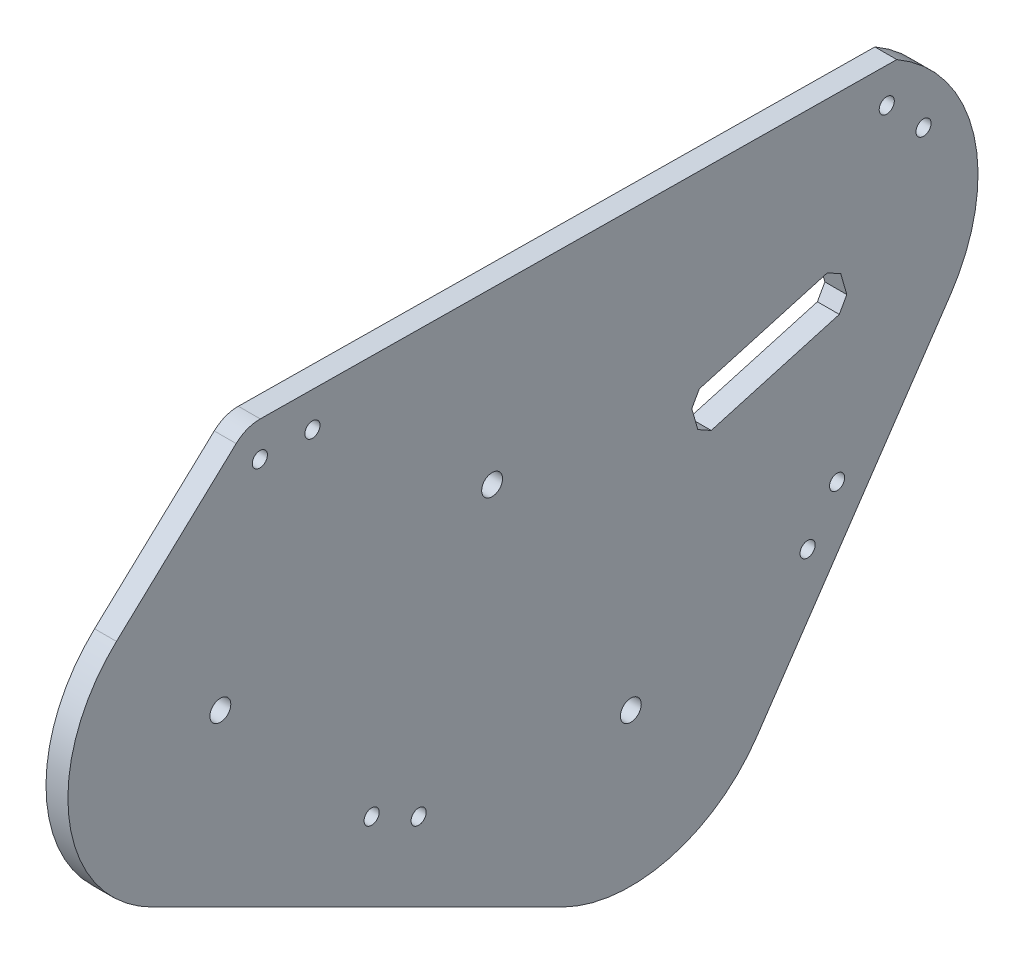
ISO-10303-21;
HEADER;
FILE_DESCRIPTION(('STEP AP214'),'2;1');
FILE_NAME('part.step','',(''),(''),'','','');
FILE_SCHEMA(('AUTOMOTIVE_DESIGN { 1 0 10303 214 1 1 1 1 }'));
ENDSEC;
DATA;
#1=APPLICATION_CONTEXT('core data for automotive mechanical design processes');
#2=APPLICATION_PROTOCOL_DEFINITION('international standard','automotive_design',2000,#1);
#3=PRODUCT_CONTEXT('',#1,'mechanical');
#4=PRODUCT('Part','Part','',(#3));
#5=PRODUCT_RELATED_PRODUCT_CATEGORY('part','',(#4));
#6=PRODUCT_DEFINITION_FORMATION('','',#4);
#7=PRODUCT_DEFINITION_CONTEXT('part definition',#1,'design');
#8=PRODUCT_DEFINITION('design','',#6,#7);
#9=PRODUCT_DEFINITION_SHAPE('','',#8);
#10=(LENGTH_UNIT() NAMED_UNIT(*) SI_UNIT(.MILLI.,.METRE.));
#11=(NAMED_UNIT(*) PLANE_ANGLE_UNIT() SI_UNIT($,.RADIAN.));
#12=(NAMED_UNIT(*) SI_UNIT($,.STERADIAN.) SOLID_ANGLE_UNIT());
#13=UNCERTAINTY_MEASURE_WITH_UNIT(LENGTH_MEASURE(1.E-05),#10,'distance_accuracy_value','');
#14=(GEOMETRIC_REPRESENTATION_CONTEXT(3) GLOBAL_UNCERTAINTY_ASSIGNED_CONTEXT((#13)) GLOBAL_UNIT_ASSIGNED_CONTEXT((#10,
#11,#12)) REPRESENTATION_CONTEXT('',''));
#15=CARTESIAN_POINT('',(0.,0.,0.));
#16=DIRECTION('',(0.,0.,1.));
#17=DIRECTION('',(1.,0.,0.));
#18=AXIS2_PLACEMENT_3D('',#15,#16,#17);
#19=CARTESIAN_POINT('',(-5.,-15.0065003575197,519.783421192923));
#20=DIRECTION('',(1.,0.,0.));
#21=DIRECTION('',(0.,0.,-1.));
#22=AXIS2_PLACEMENT_3D('',#19,#20,#21);
#23=CYLINDRICAL_SURFACE('',#22,34.8040999999985);
#24=CARTESIAN_POINT('',(0.,-15.0065003575197,519.783421192923));
#25=DIRECTION('',(1.,0.,0.));
#26=DIRECTION('',(0.,0.,-1.));
#27=AXIS2_PLACEMENT_3D('',#24,#25,#26);
#28=CIRCLE('',#27,34.8040999999985);
#29=CARTESIAN_POINT('',(0.,10.4622867101921,543.504008498244));
#30=VERTEX_POINT('',#29);
#31=CARTESIAN_POINT('',(0.,-46.1378840028759,535.344986960405));
#32=VERTEX_POINT('',#31);
#33=EDGE_CURVE('E325',#30,#32,#28,.T.);
#34=ORIENTED_EDGE('',*,*,#33,.F.);
#35=DIRECTION('',(1.,0.,0.));
#36=VECTOR('',#35,1.);
#37=CARTESIAN_POINT('',(-5.,10.4622867101921,543.504008498244));
#38=LINE('',#37,#36);
#39=CARTESIAN_POINT('',(-5.,10.4622867101921,543.504008498244));
#40=VERTEX_POINT('',#39);
#41=EDGE_CURVE('E12',#40,#30,#38,.T.);
#42=ORIENTED_EDGE('',*,*,#41,.F.);
#43=CARTESIAN_POINT('',(-5.,-15.0065003575197,519.783421192923));
#44=DIRECTION('',(1.,0.,0.));
#45=DIRECTION('',(0.,0.,-1.));
#46=AXIS2_PLACEMENT_3D('',#43,#44,#45);
#47=CIRCLE('',#46,34.8040999999985);
#48=CARTESIAN_POINT('',(-5.,-46.1378840028759,535.344986960405));
#49=VERTEX_POINT('',#48);
#50=EDGE_CURVE('E301',#40,#49,#47,.T.);
#51=ORIENTED_EDGE('',*,*,#50,.T.);
#52=DIRECTION('',(1.,0.,0.));
#53=VECTOR('',#52,1.);
#54=CARTESIAN_POINT('',(-5.,-46.1378840028759,535.344986960405));
#55=LINE('',#54,#53);
#56=EDGE_CURVE('E43',#49,#32,#55,.T.);
#57=ORIENTED_EDGE('',*,*,#56,.T.);
#58=EDGE_LOOP('',(#34,#42,#51,#57));
#59=FACE_BOUND('',#58,.T.);
#60=ADVANCED_FACE('F40',(#59),#23,.T.);
#61=CARTESIAN_POINT('',(-5.,10.4622867101921,543.504008498244));
#62=DIRECTION('',(0.,0.73177548242058,0.681545774932343));
#63=DIRECTION('',(0.,-0.681545774932343,0.73177548242058));
#64=AXIS2_PLACEMENT_3D('',#61,#62,#63);
#65=PLANE('',#64);
#66=DIRECTION('',(0.,-0.681545774932343,0.73177548242058));
#67=VECTOR('',#66,1.);
#68=CARTESIAN_POINT('',(0.,10.4622867101921,543.504008498244));
#69=LINE('',#68,#67);
#70=CARTESIAN_POINT('',(0.,35.9103864393393,516.180391888879));
#71=VERTEX_POINT('',#70);
#72=EDGE_CURVE('E305',#71,#30,#69,.T.);
#73=ORIENTED_EDGE('',*,*,#72,.F.);
#74=DIRECTION('',(1.,0.,0.));
#75=VECTOR('',#74,1.);
#76=CARTESIAN_POINT('',(-5.,35.9103864393393,516.180391888879));
#77=LINE('',#76,#75);
#78=CARTESIAN_POINT('',(-5.,35.9103864393393,516.180391888879));
#79=VERTEX_POINT('',#78);
#80=EDGE_CURVE('E48',#79,#71,#77,.T.);
#81=ORIENTED_EDGE('',*,*,#80,.F.);
#82=DIRECTION('',(0.,-0.681545774932343,0.73177548242058));
#83=VECTOR('',#82,1.);
#84=CARTESIAN_POINT('',(-5.,10.4622867101921,543.504008498244));
#85=LINE('',#84,#83);
#86=EDGE_CURVE('E323',#79,#40,#85,.T.);
#87=ORIENTED_EDGE('',*,*,#86,.T.);
#88=ORIENTED_EDGE('',*,*,#41,.T.);
#89=EDGE_LOOP('',(#73,#81,#87,#88));
#90=FACE_BOUND('',#89,.T.);
#91=ADVANCED_FACE('F388',(#90),#65,.T.);
#92=CARTESIAN_POINT('',(-5.,30.101918547626,510.770622300354));
#93=DIRECTION('',(1.,0.,0.));
#94=DIRECTION('',(0.,0.,-1.));
#95=AXIS2_PLACEMENT_3D('',#92,#93,#94);
#96=CYLINDRICAL_SURFACE('',#95,7.93749999999995);
#97=CARTESIAN_POINT('',(0.,30.101918547626,510.770622300354));
#98=DIRECTION('',(1.,0.,0.));
#99=DIRECTION('',(0.,0.,-1.));
#100=AXIS2_PLACEMENT_3D('',#97,#98,#99);
#101=CIRCLE('',#100,7.93749999999995);
#102=CARTESIAN_POINT('',(0.,38.0389259271975,510.682190933596));
#103=VERTEX_POINT('',#102);
#104=EDGE_CURVE('E357',#103,#71,#101,.T.);
#105=ORIENTED_EDGE('',*,*,#104,.F.);
#106=DIRECTION('',(1.,0.,0.));
#107=VECTOR('',#106,1.);
#108=CARTESIAN_POINT('',(-5.,38.0389259271975,510.682190933596));
#109=LINE('',#108,#107);
#110=CARTESIAN_POINT('',(-5.,38.0389259271975,510.682190933596));
#111=VERTEX_POINT('',#110);
#112=EDGE_CURVE('E366',#111,#103,#109,.T.);
#113=ORIENTED_EDGE('',*,*,#112,.F.);
#114=CARTESIAN_POINT('',(-5.,30.101918547626,510.770622300354));
#115=DIRECTION('',(1.,0.,0.));
#116=DIRECTION('',(0.,0.,-1.));
#117=AXIS2_PLACEMENT_3D('',#114,#115,#116);
#118=CIRCLE('',#117,7.93749999999995);
#119=EDGE_CURVE('E320',#111,#79,#118,.T.);
#120=ORIENTED_EDGE('',*,*,#119,.T.);
#121=ORIENTED_EDGE('',*,*,#80,.T.);
#122=EDGE_LOOP('',(#105,#113,#120,#121));
#123=FACE_BOUND('',#122,.T.);
#124=ADVANCED_FACE('F487',(#123),#96,.T.);
#125=CARTESIAN_POINT('',(-5.,38.0389259271975,510.682190933596));
#126=DIRECTION('',(0.,0.999937937583819,-0.0111409595914756));
#127=DIRECTION('',(0.,0.0111409595914756,0.999937937583819));
#128=AXIS2_PLACEMENT_3D('',#125,#126,#127);
#129=PLANE('',#128);
#130=DIRECTION('',(0.,0.0111409595914756,0.999937937583819));
#131=VECTOR('',#130,1.);
#132=CARTESIAN_POINT('',(0.,38.0389259271975,510.682190933596));
#133=LINE('',#132,#131);
#134=CARTESIAN_POINT('',(0.,36.4199920525121,365.377526066479));
#135=VERTEX_POINT('',#134);
#136=EDGE_CURVE('E352',#135,#103,#133,.T.);
#137=ORIENTED_EDGE('',*,*,#136,.F.);
#138=DIRECTION('',(1.,0.,0.));
#139=VECTOR('',#138,1.);
#140=CARTESIAN_POINT('',(-5.,36.4199920525121,365.377526066479));
#141=LINE('',#140,#139);
#142=CARTESIAN_POINT('',(-5.,36.4199920525121,365.377526066479));
#143=VERTEX_POINT('',#142);
#144=EDGE_CURVE('E368',#143,#135,#141,.T.);
#145=ORIENTED_EDGE('',*,*,#144,.F.);
#146=DIRECTION('',(0.,0.0111409595914756,0.999937937583819));
#147=VECTOR('',#146,1.);
#148=CARTESIAN_POINT('',(-5.,38.0389259271975,510.682190933596));
#149=LINE('',#148,#147);
#150=EDGE_CURVE('E317',#143,#111,#149,.T.);
#151=ORIENTED_EDGE('',*,*,#150,.T.);
#152=ORIENTED_EDGE('',*,*,#112,.T.);
#153=EDGE_LOOP('',(#137,#145,#151,#152));
#154=FACE_BOUND('',#153,.T.);
#155=ADVANCED_FACE('F492',(#154),#129,.T.);
#156=CARTESIAN_POINT('',(-5.,4.41016788389024,383.725711423616));
#157=DIRECTION('',(1.,0.,0.));
#158=DIRECTION('',(0.,0.,-1.));
#159=AXIS2_PLACEMENT_3D('',#156,#157,#158);
#160=CYLINDRICAL_SURFACE('',#159,36.8955925444483);
#161=CARTESIAN_POINT('',(0.,4.41016788389024,383.725711423616));
#162=DIRECTION('',(1.,0.,0.));
#163=DIRECTION('',(0.,0.,-1.));
#164=AXIS2_PLACEMENT_3D('',#161,#162,#163);
#165=CIRCLE('',#164,36.8955925444483);
#166=CARTESIAN_POINT('',(0.,-16.2849314624056,353.180701810704));
#167=VERTEX_POINT('',#166);
#168=EDGE_CURVE('E347',#167,#135,#165,.T.);
#169=ORIENTED_EDGE('',*,*,#168,.F.);
#170=DIRECTION('',(1.,0.,0.));
#171=VECTOR('',#170,1.);
#172=CARTESIAN_POINT('',(-5.,-16.2849314624056,353.180701810704));
#173=LINE('',#172,#171);
#174=CARTESIAN_POINT('',(-5.,-16.2849314624056,353.180701810704));
#175=VERTEX_POINT('',#174);
#176=EDGE_CURVE('E370',#175,#167,#173,.T.);
#177=ORIENTED_EDGE('',*,*,#176,.F.);
#178=CARTESIAN_POINT('',(-5.,4.41016788389024,383.725711423616));
#179=DIRECTION('',(1.,0.,0.));
#180=DIRECTION('',(0.,0.,-1.));
#181=AXIS2_PLACEMENT_3D('',#178,#179,#180);
#182=CIRCLE('',#181,36.8955925444483);
#183=EDGE_CURVE('E314',#175,#143,#182,.T.);
#184=ORIENTED_EDGE('',*,*,#183,.T.);
#185=ORIENTED_EDGE('',*,*,#144,.T.);
#186=EDGE_LOOP('',(#169,#177,#184,#185));
#187=FACE_BOUND('',#186,.T.);
#188=ADVANCED_FACE('F498',(#187),#160,.T.);
#189=CARTESIAN_POINT('',(-5.,-81.3641503491352,397.273694980719));
#190=DIRECTION('',(0.,-0.560909797596132,-0.82787692259216));
#191=DIRECTION('',(0.,0.82787692259216,-0.560909797596132));
#192=AXIS2_PLACEMENT_3D('',#189,#190,#191);
#193=PLANE('',#192);
#194=DIRECTION('',(0.,0.82787692259216,-0.560909797596132));
#195=VECTOR('',#194,1.);
#196=CARTESIAN_POINT('',(0.,-81.3641503491352,397.273694980719));
#197=LINE('',#196,#195);
#198=CARTESIAN_POINT('',(0.,-81.3641503491352,397.273694980719));
#199=VERTEX_POINT('',#198);
#200=EDGE_CURVE('E343',#199,#167,#197,.T.);
#201=ORIENTED_EDGE('',*,*,#200,.F.);
#202=DIRECTION('',(1.,0.,0.));
#203=VECTOR('',#202,1.);
#204=CARTESIAN_POINT('',(-5.,-81.3641503491352,397.273694980719));
#205=LINE('',#204,#203);
#206=CARTESIAN_POINT('',(-5.,-81.3641503491352,397.273694980719));
#207=VERTEX_POINT('',#206);
#208=EDGE_CURVE('E372',#207,#199,#205,.T.);
#209=ORIENTED_EDGE('',*,*,#208,.F.);
#210=DIRECTION('',(0.,0.82787692259216,-0.560909797596132));
#211=VECTOR('',#210,1.);
#212=CARTESIAN_POINT('',(-5.,-81.3641503491352,397.273694980719));
#213=LINE('',#212,#211);
#214=EDGE_CURVE('E311',#207,#175,#213,.T.);
#215=ORIENTED_EDGE('',*,*,#214,.T.);
#216=ORIENTED_EDGE('',*,*,#176,.T.);
#217=EDGE_LOOP('',(#201,#209,#215,#216));
#218=FACE_BOUND('',#217,.T.);
#219=ADVANCED_FACE('F502',(#218),#193,.T.);
#220=CARTESIAN_POINT('',(-5.,-61.8421896626251,426.087206182307));
#221=DIRECTION('',(1.,0.,0.));
#222=DIRECTION('',(0.,0.,-1.));
#223=AXIS2_PLACEMENT_3D('',#220,#221,#222);
#224=CYLINDRICAL_SURFACE('',#223,34.8040999999959);
#225=CARTESIAN_POINT('',(0.,-61.8421896626251,426.087206182307));
#226=DIRECTION('',(1.,0.,0.));
#227=DIRECTION('',(0.,0.,-1.));
#228=AXIS2_PLACEMENT_3D('',#225,#226,#227);
#229=CIRCLE('',#228,34.8040999999959);
#230=CARTESIAN_POINT('',(0.,-92.9735733079768,441.648771949788));
#231=VERTEX_POINT('',#230);
#232=EDGE_CURVE('E335',#231,#199,#229,.T.);
#233=ORIENTED_EDGE('',*,*,#232,.F.);
#234=DIRECTION('',(1.,0.,0.));
#235=VECTOR('',#234,1.);
#236=CARTESIAN_POINT('',(-5.,-92.9735733079768,441.648771949788));
#237=LINE('',#236,#235);
#238=CARTESIAN_POINT('',(-5.,-92.9735733079768,441.648771949788));
#239=VERTEX_POINT('',#238);
#240=EDGE_CURVE('E373',#239,#231,#237,.T.);
#241=ORIENTED_EDGE('',*,*,#240,.F.);
#242=CARTESIAN_POINT('',(-5.,-61.8421896626251,426.087206182307));
#243=DIRECTION('',(1.,0.,0.));
#244=DIRECTION('',(0.,0.,-1.));
#245=AXIS2_PLACEMENT_3D('',#242,#243,#244);
#246=CIRCLE('',#245,34.8040999999959);
#247=EDGE_CURVE('E308',#239,#207,#246,.T.);
#248=ORIENTED_EDGE('',*,*,#247,.T.);
#249=ORIENTED_EDGE('',*,*,#208,.T.);
#250=EDGE_LOOP('',(#233,#241,#248,#249));
#251=FACE_BOUND('',#250,.T.);
#252=ADVANCED_FACE('F396',(#251),#224,.T.);
#253=CARTESIAN_POINT('',(-5.,-92.9735733079777,441.648771949789));
#254=DIRECTION('',(0.,-0.894474606306614,0.447118752316014));
#255=DIRECTION('',(0.,-0.447118752316014,-0.894474606306614));
#256=AXIS2_PLACEMENT_3D('',#253,#254,#255);
#257=PLANE('',#256);
#258=DIRECTION('',(0.,-0.447118752316014,-0.894474606306614));
#259=VECTOR('',#258,1.);
#260=CARTESIAN_POINT('',(0.,-92.9735733079777,441.648771949789));
#261=LINE('',#260,#259);
#262=EDGE_CURVE('E330',#32,#231,#261,.T.);
#263=ORIENTED_EDGE('',*,*,#262,.F.);
#264=ORIENTED_EDGE('',*,*,#56,.F.);
#265=DIRECTION('',(0.,-0.447118752316014,-0.894474606306614));
#266=VECTOR('',#265,1.);
#267=CARTESIAN_POINT('',(-5.,-92.9735733079777,441.648771949789));
#268=LINE('',#267,#266);
#269=EDGE_CURVE('E304',#49,#239,#268,.T.);
#270=ORIENTED_EDGE('',*,*,#269,.T.);
#271=ORIENTED_EDGE('',*,*,#240,.T.);
#272=EDGE_LOOP('',(#263,#264,#270,#271));
#273=FACE_BOUND('',#272,.T.);
#274=ADVANCED_FACE('F381',(#273),#257,.T.);
#275=CARTESIAN_POINT('',(-5.,-15.0065003575197,519.783421192923));
#276=DIRECTION('',(1.,0.,0.));
#277=DIRECTION('',(0.,0.,-1.));
#278=AXIS2_PLACEMENT_3D('',#275,#276,#277);
#279=PLANE('',#278);
#280=CARTESIAN_POINT('',(-5.,-15.0065003575197,519.783421192923));
#281=DIRECTION('',(1.,0.,0.));
#282=DIRECTION('',(0.,0.,-1.));
#283=AXIS2_PLACEMENT_3D('',#280,#281,#282);
#284=CIRCLE('',#283,2.38124999999995);
#285=CARTESIAN_POINT('',(-5.,-15.0065003575197,517.402171192923));
#286=VERTEX_POINT('',#285);
#287=EDGE_CURVE('E235',#286,#286,#284,.T.);
#288=ORIENTED_EDGE('',*,*,#287,.T.);
#289=EDGE_LOOP('',(#288));
#290=FACE_BOUND('',#289,.T.);
#291=CARTESIAN_POINT('',(-5.,-1.41718755012801,457.754552289623));
#292=DIRECTION('',(1.,0.,0.));
#293=DIRECTION('',(0.,0.,-1.));
#294=AXIS2_PLACEMENT_3D('',#291,#292,#293);
#295=CIRCLE('',#294,2.38125000000001);
#296=CARTESIAN_POINT('',(-5.,-1.41718755012801,455.373302289623));
#297=VERTEX_POINT('',#296);
#298=EDGE_CURVE('E423',#297,#297,#295,.T.);
#299=ORIENTED_EDGE('',*,*,#298,.T.);
#300=EDGE_LOOP('',(#299));
#301=FACE_BOUND('',#300,.T.);
#302=CARTESIAN_POINT('',(-5.,-61.8421896626215,426.087206182307));
#303=DIRECTION('',(1.,0.,0.));
#304=DIRECTION('',(0.,0.,-1.));
#305=AXIS2_PLACEMENT_3D('',#302,#303,#304);
#306=CIRCLE('',#305,2.38125);
#307=CARTESIAN_POINT('',(-5.,-61.8421896626215,423.705956182307));
#308=VERTEX_POINT('',#307);
#309=EDGE_CURVE('E419',#308,#308,#306,.T.);
#310=ORIENTED_EDGE('',*,*,#309,.T.);
#311=EDGE_LOOP('',(#310));
#312=FACE_BOUND('',#311,.T.);
#313=DIRECTION('',(0.,-0.873687878871659,0.486486886064508));
#314=VECTOR('',#313,1.);
#315=CARTESIAN_POINT('',(-5.,-6.13916106529002,410.46313141764));
#316=LINE('',#315,#314);
#317=CARTESIAN_POINT('',(-5.,-6.13916106529002,410.46313141764));
#318=VERTEX_POINT('',#317);
#319=CARTESIAN_POINT('',(-5.,-9.20324699305463,412.169275748676));
#320=VERTEX_POINT('',#319);
#321=EDGE_CURVE('E161',#318,#320,#316,.T.);
#322=ORIENTED_EDGE('',*,*,#321,.T.);
#323=DIRECTION('',(0.,-0.961788799884853,-0.273792447697256));
#324=VECTOR('',#323,1.);
#325=CARTESIAN_POINT('',(-5.,-9.20324699305463,412.169275748676));
#326=LINE('',#325,#324);
#327=CARTESIAN_POINT('',(-5.,-14.012433181109,410.800244566345));
#328=VERTEX_POINT('',#327);
#329=EDGE_CURVE('E155',#320,#328,#326,.T.);
#330=ORIENTED_EDGE('',*,*,#329,.T.);
#331=DIRECTION('',(0.,-0.486486886064026,-0.873687878871927));
#332=VECTOR('',#331,1.);
#333=CARTESIAN_POINT('',(-5.,-14.012433181109,410.800244566345));
#334=LINE('',#333,#332);
#335=CARTESIAN_POINT('',(-5.,-15.7185775121433,407.736158638581));
#336=VERTEX_POINT('',#335);
#337=EDGE_CURVE('E164',#328,#336,#334,.T.);
#338=ORIENTED_EDGE('',*,*,#337,.T.);
#339=DIRECTION('',(0.,0.273792447696789,-0.961788799884986));
#340=VECTOR('',#339,1.);
#341=CARTESIAN_POINT('',(-5.,-15.7185775121434,407.736158638581));
#342=LINE('',#341,#340);
#343=CARTESIAN_POINT('',(-5.,-7.39521815831649,378.497536933448));
#344=VERTEX_POINT('',#343);
#345=EDGE_CURVE('E56',#336,#344,#342,.T.);
#346=ORIENTED_EDGE('',*,*,#345,.T.);
#347=DIRECTION('',(0.,0.873687878872062,-0.486486886063784));
#348=VECTOR('',#347,1.);
#349=CARTESIAN_POINT('',(-5.,-7.39521815831649,378.497536933448));
#350=LINE('',#349,#348);
#351=CARTESIAN_POINT('',(-5.,-4.3311322305511,376.791392602415));
#352=VERTEX_POINT('',#351);
#353=EDGE_CURVE('E184',#344,#352,#350,.T.);
#354=ORIENTED_EDGE('',*,*,#353,.T.);
#355=DIRECTION('',(0.,0.961788799884977,0.27379244769682));
#356=VECTOR('',#355,1.);
#357=CARTESIAN_POINT('',(-5.,-4.3311322305511,376.791392602415));
#358=LINE('',#357,#356);
#359=CARTESIAN_POINT('',(-5.,0.478053957504907,378.160423784744));
#360=VERTEX_POINT('',#359);
#361=EDGE_CURVE('E187',#352,#360,#358,.T.);
#362=ORIENTED_EDGE('',*,*,#361,.T.);
#363=DIRECTION('',(0.,0.486486886063821,0.873687878872041));
#364=VECTOR('',#363,1.);
#365=CARTESIAN_POINT('',(-5.,0.478053957504907,378.160423784744));
#366=LINE('',#365,#364);
#367=CARTESIAN_POINT('',(-5.,2.18419828853847,381.224509712509));
#368=VERTEX_POINT('',#367);
#369=EDGE_CURVE('E190',#360,#368,#366,.T.);
#370=ORIENTED_EDGE('',*,*,#369,.T.);
#371=DIRECTION('',(0.,-0.273792447696849,0.961788799884968));
#372=VECTOR('',#371,1.);
#373=CARTESIAN_POINT('',(-5.,2.18419828853847,381.224509712509));
#374=LINE('',#373,#372);
#375=EDGE_CURVE('E193',#368,#318,#374,.T.);
#376=ORIENTED_EDGE('',*,*,#375,.T.);
#377=EDGE_LOOP('',(#322,#330,#338,#346,#354,#362,#370,#376));
#378=FACE_BOUND('',#377,.T.);
#379=CARTESIAN_POINT('',(-5.,-50.185658720557,385.737171654481));
#380=DIRECTION('',(1.,0.,0.));
#381=DIRECTION('',(0.,0.,-1.));
#382=AXIS2_PLACEMENT_3D('',#379,#380,#381);
#383=CIRCLE('',#382,1.72719999999997);
#384=CARTESIAN_POINT('',(-5.,-50.185658720557,384.009971654481));
#385=VERTEX_POINT('',#384);
#386=EDGE_CURVE('E226',#385,#385,#383,.T.);
#387=ORIENTED_EDGE('',*,*,#386,.T.);
#388=EDGE_LOOP('',(#387));
#389=FACE_BOUND('',#388,.T.);
#390=CARTESIAN_POINT('',(-5.,-40.2511356494511,379.006254083328));
#391=DIRECTION('',(1.,0.,0.));
#392=DIRECTION('',(0.,0.,-1.));
#393=AXIS2_PLACEMENT_3D('',#390,#391,#392);
#394=CIRCLE('',#393,1.72720000000003);
#395=CARTESIAN_POINT('',(-5.,-40.2511356494511,377.279054083328));
#396=VERTEX_POINT('',#395);
#397=EDGE_CURVE('E236',#396,#396,#394,.T.);
#398=ORIENTED_EDGE('',*,*,#397,.T.);
#399=EDGE_LOOP('',(#398));
#400=FACE_BOUND('',#399,.T.);
#401=CARTESIAN_POINT('',(-5.,19.9282164771804,359.276554144292));
#402=DIRECTION('',(1.,0.,0.));
#403=DIRECTION('',(0.,0.,-1.));
#404=AXIS2_PLACEMENT_3D('',#401,#402,#403);
#405=CIRCLE('',#404,1.72720000000003);
#406=CARTESIAN_POINT('',(-5.,19.9282164771804,357.549354144292));
#407=VERTEX_POINT('',#406);
#408=EDGE_CURVE('E249',#407,#407,#405,.T.);
#409=ORIENTED_EDGE('',*,*,#408,.T.);
#410=EDGE_LOOP('',(#409));
#411=FACE_BOUND('',#410,.T.);
#412=CARTESIAN_POINT('',(-5.,28.5075054112676,367.666774724554));
#413=DIRECTION('',(1.,0.,0.));
#414=DIRECTION('',(0.,0.,-1.));
#415=AXIS2_PLACEMENT_3D('',#412,#413,#414);
#416=CIRCLE('',#415,1.72719999999997);
#417=CARTESIAN_POINT('',(-5.,28.5075054112676,365.939574724554));
#418=VERTEX_POINT('',#417);
#419=EDGE_CURVE('E257',#418,#418,#416,.T.);
#420=ORIENTED_EDGE('',*,*,#419,.T.);
#421=EDGE_LOOP('',(#420));
#422=FACE_BOUND('',#421,.T.);
#423=CARTESIAN_POINT('',(-5.,29.9682270325283,498.771367049348));
#424=DIRECTION('',(1.,0.,0.));
#425=DIRECTION('',(0.,0.,-1.));
#426=AXIS2_PLACEMENT_3D('',#423,#424,#425);
#427=CIRCLE('',#426,1.72719999999997);
#428=CARTESIAN_POINT('',(-5.,29.9682270325283,497.044167049348));
#429=VERTEX_POINT('',#428);
#430=EDGE_CURVE('E265',#429,#429,#427,.T.);
#431=ORIENTED_EDGE('',*,*,#430,.T.);
#432=EDGE_LOOP('',(#431));
#433=FACE_BOUND('',#432,.T.);
#434=CARTESIAN_POINT('',(-5.,30.101918547626,510.770622300354));
#435=DIRECTION('',(1.,0.,0.));
#436=DIRECTION('',(0.,0.,-1.));
#437=AXIS2_PLACEMENT_3D('',#434,#435,#436);
#438=CIRCLE('',#437,1.72720000000008);
#439=CARTESIAN_POINT('',(-5.,30.101918547626,509.043422300354));
#440=VERTEX_POINT('',#439);
#441=EDGE_CURVE('E275',#440,#440,#438,.T.);
#442=ORIENTED_EDGE('',*,*,#441,.T.);
#443=EDGE_LOOP('',(#442));
#444=FACE_BOUND('',#443,.T.);
#445=CARTESIAN_POINT('',(-5.,-58.65529333969,474.518853751606));
#446=DIRECTION('',(1.,0.,0.));
#447=DIRECTION('',(0.,0.,-1.));
#448=AXIS2_PLACEMENT_3D('',#445,#446,#447);
#449=CIRCLE('',#448,1.72719999999997);
#450=CARTESIAN_POINT('',(-5.,-58.65529333969,472.791653751606));
#451=VERTEX_POINT('',#450);
#452=EDGE_CURVE('E283',#451,#451,#449,.T.);
#453=ORIENTED_EDGE('',*,*,#452,.T.);
#454=EDGE_LOOP('',(#453));
#455=FACE_BOUND('',#454,.T.);
#456=CARTESIAN_POINT('',(-5.,-53.2898683118975,485.252549027286));
#457=DIRECTION('',(1.,0.,0.));
#458=DIRECTION('',(0.,0.,-1.));
#459=AXIS2_PLACEMENT_3D('',#456,#457,#458);
#460=CIRCLE('',#459,1.72719999999997);
#461=CARTESIAN_POINT('',(-5.,-53.2898683118975,483.525349027286));
#462=VERTEX_POINT('',#461);
#463=EDGE_CURVE('E291',#462,#462,#460,.T.);
#464=ORIENTED_EDGE('',*,*,#463,.T.);
#465=EDGE_LOOP('',(#464));
#466=FACE_BOUND('',#465,.T.);
#467=ORIENTED_EDGE('',*,*,#50,.F.);
#468=ORIENTED_EDGE('',*,*,#86,.F.);
#469=ORIENTED_EDGE('',*,*,#119,.F.);
#470=ORIENTED_EDGE('',*,*,#150,.F.);
#471=ORIENTED_EDGE('',*,*,#183,.F.);
#472=ORIENTED_EDGE('',*,*,#214,.F.);
#473=ORIENTED_EDGE('',*,*,#247,.F.);
#474=ORIENTED_EDGE('',*,*,#269,.F.);
#475=EDGE_LOOP('',(#467,#468,#469,#470,#471,#472,#473,#474));
#476=FACE_BOUND('',#475,.T.);
#477=ADVANCED_FACE('F168',(#290,#301,#312,#378,#389,#400,#411,#422,#433,#444,#455,#466,#476),
#279,.F.);
#478=CARTESIAN_POINT('',(0.,-15.0065003575197,519.783421192923));
#479=DIRECTION('',(1.,0.,0.));
#480=DIRECTION('',(0.,0.,-1.));
#481=AXIS2_PLACEMENT_3D('',#478,#479,#480);
#482=PLANE('',#481);
#483=CARTESIAN_POINT('',(0.,-15.0065003575197,519.783421192923));
#484=DIRECTION('',(1.,0.,0.));
#485=DIRECTION('',(0.,0.,-1.));
#486=AXIS2_PLACEMENT_3D('',#483,#484,#485);
#487=CIRCLE('',#486,2.38124999999995);
#488=CARTESIAN_POINT('',(0.,-15.0065003575197,517.402171192923));
#489=VERTEX_POINT('',#488);
#490=EDGE_CURVE('E425',#489,#489,#487,.T.);
#491=ORIENTED_EDGE('',*,*,#490,.F.);
#492=EDGE_LOOP('',(#491));
#493=FACE_BOUND('',#492,.T.);
#494=CARTESIAN_POINT('',(0.,-1.41718755012801,457.754552289623));
#495=DIRECTION('',(1.,0.,0.));
#496=DIRECTION('',(0.,0.,-1.));
#497=AXIS2_PLACEMENT_3D('',#494,#495,#496);
#498=CIRCLE('',#497,2.38125000000001);
#499=CARTESIAN_POINT('',(0.,-1.41718755012801,455.373302289623));
#500=VERTEX_POINT('',#499);
#501=EDGE_CURVE('E420',#500,#500,#498,.T.);
#502=ORIENTED_EDGE('',*,*,#501,.F.);
#503=EDGE_LOOP('',(#502));
#504=FACE_BOUND('',#503,.T.);
#505=CARTESIAN_POINT('',(0.,-61.8421896626215,426.087206182307));
#506=DIRECTION('',(1.,0.,0.));
#507=DIRECTION('',(0.,0.,-1.));
#508=AXIS2_PLACEMENT_3D('',#505,#506,#507);
#509=CIRCLE('',#508,2.38125);
#510=CARTESIAN_POINT('',(0.,-61.8421896626215,423.705956182307));
#511=VERTEX_POINT('',#510);
#512=EDGE_CURVE('E179',#511,#511,#509,.T.);
#513=ORIENTED_EDGE('',*,*,#512,.F.);
#514=EDGE_LOOP('',(#513));
#515=FACE_BOUND('',#514,.T.);
#516=DIRECTION('',(0.,-0.961788799884853,-0.273792447697256));
#517=VECTOR('',#516,1.);
#518=CARTESIAN_POINT('',(0.,-9.20324699305463,412.169275748676));
#519=LINE('',#518,#517);
#520=CARTESIAN_POINT('',(0.,-9.20324699305463,412.169275748676));
#521=VERTEX_POINT('',#520);
#522=CARTESIAN_POINT('',(0.,-14.012433181109,410.800244566345));
#523=VERTEX_POINT('',#522);
#524=EDGE_CURVE('E64',#521,#523,#519,.T.);
#525=ORIENTED_EDGE('',*,*,#524,.F.);
#526=DIRECTION('',(0.,-0.873687878871659,0.486486886064508));
#527=VECTOR('',#526,1.);
#528=CARTESIAN_POINT('',(0.,-6.13916106529002,410.46313141764));
#529=LINE('',#528,#527);
#530=CARTESIAN_POINT('',(0.,-6.13916106529002,410.46313141764));
#531=VERTEX_POINT('',#530);
#532=EDGE_CURVE('E172',#531,#521,#529,.T.);
#533=ORIENTED_EDGE('',*,*,#532,.F.);
#534=DIRECTION('',(0.,-0.273792447696849,0.961788799884968));
#535=VECTOR('',#534,1.);
#536=CARTESIAN_POINT('',(0.,2.18419828853847,381.224509712509));
#537=LINE('',#536,#535);
#538=CARTESIAN_POINT('',(0.,2.18419828853847,381.224509712509));
#539=VERTEX_POINT('',#538);
#540=EDGE_CURVE('E176',#539,#531,#537,.T.);
#541=ORIENTED_EDGE('',*,*,#540,.F.);
#542=DIRECTION('',(0.,0.486486886063821,0.873687878872041));
#543=VECTOR('',#542,1.);
#544=CARTESIAN_POINT('',(0.,0.478053957504907,378.160423784744));
#545=LINE('',#544,#543);
#546=CARTESIAN_POINT('',(0.,0.478053957504907,378.160423784744));
#547=VERTEX_POINT('',#546);
#548=EDGE_CURVE('E411',#547,#539,#545,.T.);
#549=ORIENTED_EDGE('',*,*,#548,.F.);
#550=DIRECTION('',(0.,0.961788799884977,0.27379244769682));
#551=VECTOR('',#550,1.);
#552=CARTESIAN_POINT('',(0.,-4.3311322305511,376.791392602415));
#553=LINE('',#552,#551);
#554=CARTESIAN_POINT('',(0.,-4.3311322305511,376.791392602415));
#555=VERTEX_POINT('',#554);
#556=EDGE_CURVE('E407',#555,#547,#553,.T.);
#557=ORIENTED_EDGE('',*,*,#556,.F.);
#558=DIRECTION('',(0.,0.873687878872062,-0.486486886063784));
#559=VECTOR('',#558,1.);
#560=CARTESIAN_POINT('',(0.,-7.39521815831649,378.497536933448));
#561=LINE('',#560,#559);
#562=CARTESIAN_POINT('',(0.,-7.39521815831649,378.497536933448));
#563=VERTEX_POINT('',#562);
#564=EDGE_CURVE('E404',#563,#555,#561,.T.);
#565=ORIENTED_EDGE('',*,*,#564,.F.);
#566=DIRECTION('',(0.,0.273792447696789,-0.961788799884986));
#567=VECTOR('',#566,1.);
#568=CARTESIAN_POINT('',(0.,-15.7185775121434,407.736158638581));
#569=LINE('',#568,#567);
#570=CARTESIAN_POINT('',(0.,-15.7185775121434,407.736158638581));
#571=VERTEX_POINT('',#570);
#572=EDGE_CURVE('E401',#571,#563,#569,.T.);
#573=ORIENTED_EDGE('',*,*,#572,.F.);
#574=DIRECTION('',(0.,-0.486486886064026,-0.873687878871927));
#575=VECTOR('',#574,1.);
#576=CARTESIAN_POINT('',(0.,-14.012433181109,410.800244566345));
#577=LINE('',#576,#575);
#578=EDGE_CURVE('E199',#523,#571,#577,.T.);
#579=ORIENTED_EDGE('',*,*,#578,.F.);
#580=EDGE_LOOP('',(#525,#533,#541,#549,#557,#565,#573,#579));
#581=FACE_BOUND('',#580,.T.);
#582=CARTESIAN_POINT('',(0.,-50.185658720557,385.737171654481));
#583=DIRECTION('',(1.,0.,0.));
#584=DIRECTION('',(0.,0.,-1.));
#585=AXIS2_PLACEMENT_3D('',#582,#583,#584);
#586=CIRCLE('',#585,1.72719999999997);
#587=CARTESIAN_POINT('',(0.,-50.185658720557,384.009971654481));
#588=VERTEX_POINT('',#587);
#589=EDGE_CURVE('E230',#588,#588,#586,.T.);
#590=ORIENTED_EDGE('',*,*,#589,.F.);
#591=EDGE_LOOP('',(#590));
#592=FACE_BOUND('',#591,.T.);
#593=CARTESIAN_POINT('',(0.,-40.2511356494511,379.006254083328));
#594=DIRECTION('',(1.,0.,0.));
#595=DIRECTION('',(0.,0.,-1.));
#596=AXIS2_PLACEMENT_3D('',#593,#594,#595);
#597=CIRCLE('',#596,1.72720000000003);
#598=CARTESIAN_POINT('',(0.,-40.2511356494511,377.279054083328));
#599=VERTEX_POINT('',#598);
#600=EDGE_CURVE('E229',#599,#599,#597,.T.);
#601=ORIENTED_EDGE('',*,*,#600,.F.);
#602=EDGE_LOOP('',(#601));
#603=FACE_BOUND('',#602,.T.);
#604=CARTESIAN_POINT('',(0.,19.9282164771804,359.276554144292));
#605=DIRECTION('',(1.,0.,0.));
#606=DIRECTION('',(0.,0.,-1.));
#607=AXIS2_PLACEMENT_3D('',#604,#605,#606);
#608=CIRCLE('',#607,1.72720000000003);
#609=CARTESIAN_POINT('',(0.,19.9282164771804,357.549354144292));
#610=VERTEX_POINT('',#609);
#611=EDGE_CURVE('E252',#610,#610,#608,.T.);
#612=ORIENTED_EDGE('',*,*,#611,.F.);
#613=EDGE_LOOP('',(#612));
#614=FACE_BOUND('',#613,.T.);
#615=CARTESIAN_POINT('',(0.,28.5075054112676,367.666774724554));
#616=DIRECTION('',(1.,0.,0.));
#617=DIRECTION('',(0.,0.,-1.));
#618=AXIS2_PLACEMENT_3D('',#615,#616,#617);
#619=CIRCLE('',#618,1.72719999999997);
#620=CARTESIAN_POINT('',(0.,28.5075054112676,365.939574724554));
#621=VERTEX_POINT('',#620);
#622=EDGE_CURVE('E251',#621,#621,#619,.T.);
#623=ORIENTED_EDGE('',*,*,#622,.F.);
#624=EDGE_LOOP('',(#623));
#625=FACE_BOUND('',#624,.T.);
#626=CARTESIAN_POINT('',(0.,29.9682270325283,498.771367049348));
#627=DIRECTION('',(1.,0.,0.));
#628=DIRECTION('',(0.,0.,-1.));
#629=AXIS2_PLACEMENT_3D('',#626,#627,#628);
#630=CIRCLE('',#629,1.72719999999997);
#631=CARTESIAN_POINT('',(0.,29.9682270325283,497.044167049348));
#632=VERTEX_POINT('',#631);
#633=EDGE_CURVE('E260',#632,#632,#630,.T.);
#634=ORIENTED_EDGE('',*,*,#633,.F.);
#635=EDGE_LOOP('',(#634));
#636=FACE_BOUND('',#635,.T.);
#637=CARTESIAN_POINT('',(0.,30.101918547626,510.770622300354));
#638=DIRECTION('',(1.,0.,0.));
#639=DIRECTION('',(0.,0.,-1.));
#640=AXIS2_PLACEMENT_3D('',#637,#638,#639);
#641=CIRCLE('',#640,1.72720000000008);
#642=CARTESIAN_POINT('',(0.,30.101918547626,509.043422300354));
#643=VERTEX_POINT('',#642);
#644=EDGE_CURVE('E278',#643,#643,#641,.T.);
#645=ORIENTED_EDGE('',*,*,#644,.F.);
#646=EDGE_LOOP('',(#645));
#647=FACE_BOUND('',#646,.T.);
#648=CARTESIAN_POINT('',(0.,-58.65529333969,474.518853751606));
#649=DIRECTION('',(1.,0.,0.));
#650=DIRECTION('',(0.,0.,-1.));
#651=AXIS2_PLACEMENT_3D('',#648,#649,#650);
#652=CIRCLE('',#651,1.72719999999997);
#653=CARTESIAN_POINT('',(0.,-58.65529333969,472.791653751606));
#654=VERTEX_POINT('',#653);
#655=EDGE_CURVE('E277',#654,#654,#652,.T.);
#656=ORIENTED_EDGE('',*,*,#655,.F.);
#657=EDGE_LOOP('',(#656));
#658=FACE_BOUND('',#657,.T.);
#659=CARTESIAN_POINT('',(0.,-53.2898683118975,485.252549027286));
#660=DIRECTION('',(1.,0.,0.));
#661=DIRECTION('',(0.,0.,-1.));
#662=AXIS2_PLACEMENT_3D('',#659,#660,#661);
#663=CIRCLE('',#662,1.72719999999997);
#664=CARTESIAN_POINT('',(0.,-53.2898683118975,483.525349027286));
#665=VERTEX_POINT('',#664);
#666=EDGE_CURVE('E286',#665,#665,#663,.T.);
#667=ORIENTED_EDGE('',*,*,#666,.F.);
#668=EDGE_LOOP('',(#667));
#669=FACE_BOUND('',#668,.T.);
#670=ORIENTED_EDGE('',*,*,#33,.T.);
#671=ORIENTED_EDGE('',*,*,#262,.T.);
#672=ORIENTED_EDGE('',*,*,#232,.T.);
#673=ORIENTED_EDGE('',*,*,#200,.T.);
#674=ORIENTED_EDGE('',*,*,#168,.T.);
#675=ORIENTED_EDGE('',*,*,#136,.T.);
#676=ORIENTED_EDGE('',*,*,#104,.T.);
#677=ORIENTED_EDGE('',*,*,#72,.T.);
#678=EDGE_LOOP('',(#670,#671,#672,#673,#674,#675,#676,#677));
#679=FACE_BOUND('',#678,.T.);
#680=ADVANCED_FACE('F384',(#493,#504,#515,#581,#592,#603,#614,#625,#636,#647,#658,#669,#679),
#482,.T.);
#681=CARTESIAN_POINT('',(-5.,-53.2898683118975,485.252549027286));
#682=DIRECTION('',(1.,0.,0.));
#683=DIRECTION('',(0.,0.,-1.));
#684=AXIS2_PLACEMENT_3D('',#681,#682,#683);
#685=CYLINDRICAL_SURFACE('',#684,1.72719999999997);
#686=ORIENTED_EDGE('',*,*,#463,.F.);
#687=EDGE_LOOP('',(#686));
#688=FACE_BOUND('',#687,.T.);
#689=ORIENTED_EDGE('',*,*,#666,.T.);
#690=EDGE_LOOP('',(#689));
#691=FACE_BOUND('',#690,.T.);
#692=ADVANCED_FACE('F450',(#688,#691),#685,.F.);
#693=CARTESIAN_POINT('',(-5.,-58.65529333969,474.518853751606));
#694=DIRECTION('',(1.,0.,0.));
#695=DIRECTION('',(0.,0.,-1.));
#696=AXIS2_PLACEMENT_3D('',#693,#694,#695);
#697=CYLINDRICAL_SURFACE('',#696,1.72719999999997);
#698=ORIENTED_EDGE('',*,*,#452,.F.);
#699=EDGE_LOOP('',(#698));
#700=FACE_BOUND('',#699,.T.);
#701=ORIENTED_EDGE('',*,*,#655,.T.);
#702=EDGE_LOOP('',(#701));
#703=FACE_BOUND('',#702,.T.);
#704=ADVANCED_FACE('F472',(#700,#703),#697,.F.);
#705=CARTESIAN_POINT('',(-5.,30.101918547626,510.770622300354));
#706=DIRECTION('',(1.,0.,0.));
#707=DIRECTION('',(0.,0.,-1.));
#708=AXIS2_PLACEMENT_3D('',#705,#706,#707);
#709=CYLINDRICAL_SURFACE('',#708,1.72720000000008);
#710=ORIENTED_EDGE('',*,*,#441,.F.);
#711=EDGE_LOOP('',(#710));
#712=FACE_BOUND('',#711,.T.);
#713=ORIENTED_EDGE('',*,*,#644,.T.);
#714=EDGE_LOOP('',(#713));
#715=FACE_BOUND('',#714,.T.);
#716=ADVANCED_FACE('F478',(#712,#715),#709,.F.);
#717=CARTESIAN_POINT('',(-5.,29.9682270325283,498.771367049348));
#718=DIRECTION('',(1.,0.,0.));
#719=DIRECTION('',(0.,0.,-1.));
#720=AXIS2_PLACEMENT_3D('',#717,#718,#719);
#721=CYLINDRICAL_SURFACE('',#720,1.72719999999997);
#722=ORIENTED_EDGE('',*,*,#430,.F.);
#723=EDGE_LOOP('',(#722));
#724=FACE_BOUND('',#723,.T.);
#725=ORIENTED_EDGE('',*,*,#633,.T.);
#726=EDGE_LOOP('',(#725));
#727=FACE_BOUND('',#726,.T.);
#728=ADVANCED_FACE('F573',(#724,#727),#721,.F.);
#729=CARTESIAN_POINT('',(-5.,28.5075054112676,367.666774724554));
#730=DIRECTION('',(1.,0.,0.));
#731=DIRECTION('',(0.,0.,-1.));
#732=AXIS2_PLACEMENT_3D('',#729,#730,#731);
#733=CYLINDRICAL_SURFACE('',#732,1.72719999999997);
#734=ORIENTED_EDGE('',*,*,#419,.F.);
#735=EDGE_LOOP('',(#734));
#736=FACE_BOUND('',#735,.T.);
#737=ORIENTED_EDGE('',*,*,#622,.T.);
#738=EDGE_LOOP('',(#737));
#739=FACE_BOUND('',#738,.T.);
#740=ADVANCED_FACE('F569',(#736,#739),#733,.F.);
#741=CARTESIAN_POINT('',(-5.,19.9282164771804,359.276554144292));
#742=DIRECTION('',(1.,0.,0.));
#743=DIRECTION('',(0.,0.,-1.));
#744=AXIS2_PLACEMENT_3D('',#741,#742,#743);
#745=CYLINDRICAL_SURFACE('',#744,1.72720000000003);
#746=ORIENTED_EDGE('',*,*,#408,.F.);
#747=EDGE_LOOP('',(#746));
#748=FACE_BOUND('',#747,.T.);
#749=ORIENTED_EDGE('',*,*,#611,.T.);
#750=EDGE_LOOP('',(#749));
#751=FACE_BOUND('',#750,.T.);
#752=ADVANCED_FACE('F565',(#748,#751),#745,.F.);
#753=CARTESIAN_POINT('',(-5.,-40.2511356494511,379.006254083328));
#754=DIRECTION('',(1.,0.,0.));
#755=DIRECTION('',(0.,0.,-1.));
#756=AXIS2_PLACEMENT_3D('',#753,#754,#755);
#757=CYLINDRICAL_SURFACE('',#756,1.72720000000003);
#758=ORIENTED_EDGE('',*,*,#397,.F.);
#759=EDGE_LOOP('',(#758));
#760=FACE_BOUND('',#759,.T.);
#761=ORIENTED_EDGE('',*,*,#600,.T.);
#762=EDGE_LOOP('',(#761));
#763=FACE_BOUND('',#762,.T.);
#764=ADVANCED_FACE('F561',(#760,#763),#757,.F.);
#765=CARTESIAN_POINT('',(-5.,-50.185658720557,385.737171654481));
#766=DIRECTION('',(1.,0.,0.));
#767=DIRECTION('',(0.,0.,-1.));
#768=AXIS2_PLACEMENT_3D('',#765,#766,#767);
#769=CYLINDRICAL_SURFACE('',#768,1.72719999999997);
#770=ORIENTED_EDGE('',*,*,#386,.F.);
#771=EDGE_LOOP('',(#770));
#772=FACE_BOUND('',#771,.T.);
#773=ORIENTED_EDGE('',*,*,#589,.T.);
#774=EDGE_LOOP('',(#773));
#775=FACE_BOUND('',#774,.T.);
#776=ADVANCED_FACE('F558',(#772,#775),#769,.F.);
#777=CARTESIAN_POINT('',(-5.,-9.20324699305463,412.169275748676));
#778=DIRECTION('',(0.,-0.273792447697256,0.961788799884853));
#779=DIRECTION('',(0.,-0.961788799884853,-0.273792447697256));
#780=AXIS2_PLACEMENT_3D('',#777,#778,#779);
#781=PLANE('',#780);
#782=ORIENTED_EDGE('',*,*,#524,.T.);
#783=DIRECTION('',(1.,0.,0.));
#784=VECTOR('',#783,1.);
#785=CARTESIAN_POINT('',(-5.,-14.012433181109,410.800244566345));
#786=LINE('',#785,#784);
#787=EDGE_CURVE('E151',#328,#523,#786,.T.);
#788=ORIENTED_EDGE('',*,*,#787,.F.);
#789=ORIENTED_EDGE('',*,*,#329,.F.);
#790=DIRECTION('',(1.,0.,0.));
#791=VECTOR('',#790,1.);
#792=CARTESIAN_POINT('',(-5.,-9.20324699305463,412.169275748676));
#793=LINE('',#792,#791);
#794=EDGE_CURVE('E213',#320,#521,#793,.T.);
#795=ORIENTED_EDGE('',*,*,#794,.T.);
#796=EDGE_LOOP('',(#782,#788,#789,#795));
#797=FACE_BOUND('',#796,.T.);
#798=ADVANCED_FACE('F153',(#797),#781,.F.);
#799=CARTESIAN_POINT('',(-5.,-6.13916106529002,410.46313141764));
#800=DIRECTION('',(0.,0.486486886064508,0.873687878871659));
#801=DIRECTION('',(0.,-0.873687878871659,0.486486886064508));
#802=AXIS2_PLACEMENT_3D('',#799,#800,#801);
#803=PLANE('',#802);
#804=ORIENTED_EDGE('',*,*,#532,.T.);
#805=ORIENTED_EDGE('',*,*,#794,.F.);
#806=ORIENTED_EDGE('',*,*,#321,.F.);
#807=DIRECTION('',(1.,0.,0.));
#808=VECTOR('',#807,1.);
#809=CARTESIAN_POINT('',(-5.,-6.13916106529002,410.46313141764));
#810=LINE('',#809,#808);
#811=EDGE_CURVE('E215',#318,#531,#810,.T.);
#812=ORIENTED_EDGE('',*,*,#811,.T.);
#813=EDGE_LOOP('',(#804,#805,#806,#812));
#814=FACE_BOUND('',#813,.T.);
#815=ADVANCED_FACE('F531',(#814),#803,.F.);
#816=CARTESIAN_POINT('',(-5.,2.18419828853847,381.224509712509));
#817=DIRECTION('',(0.,0.961788799884969,0.273792447696849));
#818=DIRECTION('',(0.,-0.273792447696849,0.961788799884969));
#819=AXIS2_PLACEMENT_3D('',#816,#817,#818);
#820=PLANE('',#819);
#821=ORIENTED_EDGE('',*,*,#540,.T.);
#822=ORIENTED_EDGE('',*,*,#811,.F.);
#823=ORIENTED_EDGE('',*,*,#375,.F.);
#824=DIRECTION('',(1.,0.,0.));
#825=VECTOR('',#824,1.);
#826=CARTESIAN_POINT('',(-5.,2.18419828853847,381.224509712509));
#827=LINE('',#826,#825);
#828=EDGE_CURVE('E217',#368,#539,#827,.T.);
#829=ORIENTED_EDGE('',*,*,#828,.T.);
#830=EDGE_LOOP('',(#821,#822,#823,#829));
#831=FACE_BOUND('',#830,.T.);
#832=ADVANCED_FACE('F534',(#831),#820,.F.);
#833=CARTESIAN_POINT('',(-5.,0.478053957504907,378.160423784744));
#834=DIRECTION('',(0.,0.873687878872042,-0.486486886063821));
#835=DIRECTION('',(0.,0.486486886063821,0.873687878872042));
#836=AXIS2_PLACEMENT_3D('',#833,#834,#835);
#837=PLANE('',#836);
#838=ORIENTED_EDGE('',*,*,#548,.T.);
#839=ORIENTED_EDGE('',*,*,#828,.F.);
#840=ORIENTED_EDGE('',*,*,#369,.F.);
#841=DIRECTION('',(1.,0.,0.));
#842=VECTOR('',#841,1.);
#843=CARTESIAN_POINT('',(-5.,0.478053957504907,378.160423784744));
#844=LINE('',#843,#842);
#845=EDGE_CURVE('E219',#360,#547,#844,.T.);
#846=ORIENTED_EDGE('',*,*,#845,.T.);
#847=EDGE_LOOP('',(#838,#839,#840,#846));
#848=FACE_BOUND('',#847,.T.);
#849=ADVANCED_FACE('F538',(#848),#837,.F.);
#850=CARTESIAN_POINT('',(-5.,-4.3311322305511,376.791392602415));
#851=DIRECTION('',(0.,0.27379244769682,-0.961788799884977));
#852=DIRECTION('',(0.,0.961788799884977,0.27379244769682));
#853=AXIS2_PLACEMENT_3D('',#850,#851,#852);
#854=PLANE('',#853);
#855=ORIENTED_EDGE('',*,*,#556,.T.);
#856=ORIENTED_EDGE('',*,*,#845,.F.);
#857=ORIENTED_EDGE('',*,*,#361,.F.);
#858=DIRECTION('',(1.,0.,0.));
#859=VECTOR('',#858,1.);
#860=CARTESIAN_POINT('',(-5.,-4.3311322305511,376.791392602415));
#861=LINE('',#860,#859);
#862=EDGE_CURVE('E221',#352,#555,#861,.T.);
#863=ORIENTED_EDGE('',*,*,#862,.T.);
#864=EDGE_LOOP('',(#855,#856,#857,#863));
#865=FACE_BOUND('',#864,.T.);
#866=ADVANCED_FACE('F542',(#865),#854,.F.);
#867=CARTESIAN_POINT('',(-5.,-7.39521815831649,378.497536933448));
#868=DIRECTION('',(0.,-0.486486886063784,-0.873687878872062));
#869=DIRECTION('',(0.,0.873687878872062,-0.486486886063784));
#870=AXIS2_PLACEMENT_3D('',#867,#868,#869);
#871=PLANE('',#870);
#872=ORIENTED_EDGE('',*,*,#564,.T.);
#873=ORIENTED_EDGE('',*,*,#862,.F.);
#874=ORIENTED_EDGE('',*,*,#353,.F.);
#875=DIRECTION('',(1.,0.,0.));
#876=VECTOR('',#875,1.);
#877=CARTESIAN_POINT('',(-5.,-7.39521815831649,378.497536933448));
#878=LINE('',#877,#876);
#879=EDGE_CURVE('E223',#344,#563,#878,.T.);
#880=ORIENTED_EDGE('',*,*,#879,.T.);
#881=EDGE_LOOP('',(#872,#873,#874,#880));
#882=FACE_BOUND('',#881,.T.);
#883=ADVANCED_FACE('F546',(#882),#871,.F.);
#884=CARTESIAN_POINT('',(-5.,-15.7185775121434,407.736158638581));
#885=DIRECTION('',(0.,-0.961788799884986,-0.273792447696789));
#886=DIRECTION('',(0.,0.273792447696789,-0.961788799884986));
#887=AXIS2_PLACEMENT_3D('',#884,#885,#886);
#888=PLANE('',#887);
#889=ORIENTED_EDGE('',*,*,#572,.T.);
#890=ORIENTED_EDGE('',*,*,#879,.F.);
#891=ORIENTED_EDGE('',*,*,#345,.F.);
#892=DIRECTION('',(1.,0.,0.));
#893=VECTOR('',#892,1.);
#894=CARTESIAN_POINT('',(-5.,-15.7185775121434,407.736158638581));
#895=LINE('',#894,#893);
#896=EDGE_CURVE('E160',#336,#571,#895,.T.);
#897=ORIENTED_EDGE('',*,*,#896,.T.);
#898=EDGE_LOOP('',(#889,#890,#891,#897));
#899=FACE_BOUND('',#898,.T.);
#900=ADVANCED_FACE('F550',(#899),#888,.F.);
#901=CARTESIAN_POINT('',(-5.,-14.012433181109,410.800244566345));
#902=DIRECTION('',(0.,-0.873687878871927,0.486486886064026));
#903=DIRECTION('',(0.,-0.486486886064026,-0.873687878871927));
#904=AXIS2_PLACEMENT_3D('',#901,#902,#903);
#905=PLANE('',#904);
#906=ORIENTED_EDGE('',*,*,#578,.T.);
#907=ORIENTED_EDGE('',*,*,#896,.F.);
#908=ORIENTED_EDGE('',*,*,#337,.F.);
#909=ORIENTED_EDGE('',*,*,#787,.T.);
#910=EDGE_LOOP('',(#906,#907,#908,#909));
#911=FACE_BOUND('',#910,.T.);
#912=ADVANCED_FACE('F165',(#911),#905,.F.);
#913=CARTESIAN_POINT('',(-5.,-61.8421896626215,426.087206182307));
#914=DIRECTION('',(1.,0.,0.));
#915=DIRECTION('',(0.,0.,-1.));
#916=AXIS2_PLACEMENT_3D('',#913,#914,#915);
#917=CYLINDRICAL_SURFACE('',#916,2.38125);
#918=ORIENTED_EDGE('',*,*,#309,.F.);
#919=EDGE_LOOP('',(#918));
#920=FACE_BOUND('',#919,.T.);
#921=ORIENTED_EDGE('',*,*,#512,.T.);
#922=EDGE_LOOP('',(#921));
#923=FACE_BOUND('',#922,.T.);
#924=ADVANCED_FACE('F441',(#920,#923),#917,.F.);
#925=CARTESIAN_POINT('',(-5.,-1.41718755012801,457.754552289623));
#926=DIRECTION('',(1.,0.,0.));
#927=DIRECTION('',(0.,0.,-1.));
#928=AXIS2_PLACEMENT_3D('',#925,#926,#927);
#929=CYLINDRICAL_SURFACE('',#928,2.38125000000001);
#930=ORIENTED_EDGE('',*,*,#298,.F.);
#931=EDGE_LOOP('',(#930));
#932=FACE_BOUND('',#931,.T.);
#933=ORIENTED_EDGE('',*,*,#501,.T.);
#934=EDGE_LOOP('',(#933));
#935=FACE_BOUND('',#934,.T.);
#936=ADVANCED_FACE('F444',(#932,#935),#929,.F.);
#937=CARTESIAN_POINT('',(-5.,-15.0065003575197,519.783421192923));
#938=DIRECTION('',(1.,0.,0.));
#939=DIRECTION('',(0.,0.,-1.));
#940=AXIS2_PLACEMENT_3D('',#937,#938,#939);
#941=CYLINDRICAL_SURFACE('',#940,2.38124999999995);
#942=ORIENTED_EDGE('',*,*,#287,.F.);
#943=EDGE_LOOP('',(#942));
#944=FACE_BOUND('',#943,.T.);
#945=ORIENTED_EDGE('',*,*,#490,.T.);
#946=EDGE_LOOP('',(#945));
#947=FACE_BOUND('',#946,.T.);
#948=ADVANCED_FACE('F521',(#944,#947),#941,.F.);
#949=CLOSED_SHELL('',(#60,#91,#124,#155,#188,#219,#252,#274,#477,#680,#692,#704,#716,#728,#740,
#752,#764,#776,#798,#815,#832,#849,#866,#883,#900,#912,#924,#936,#948));
#950=MANIFOLD_SOLID_BREP('B2',#949);
#951=ADVANCED_BREP_SHAPE_REPRESENTATION('',(#18,#950),#14);
#952=SHAPE_DEFINITION_REPRESENTATION(#9,#951);
ENDSEC;
END-ISO-10303-21;
